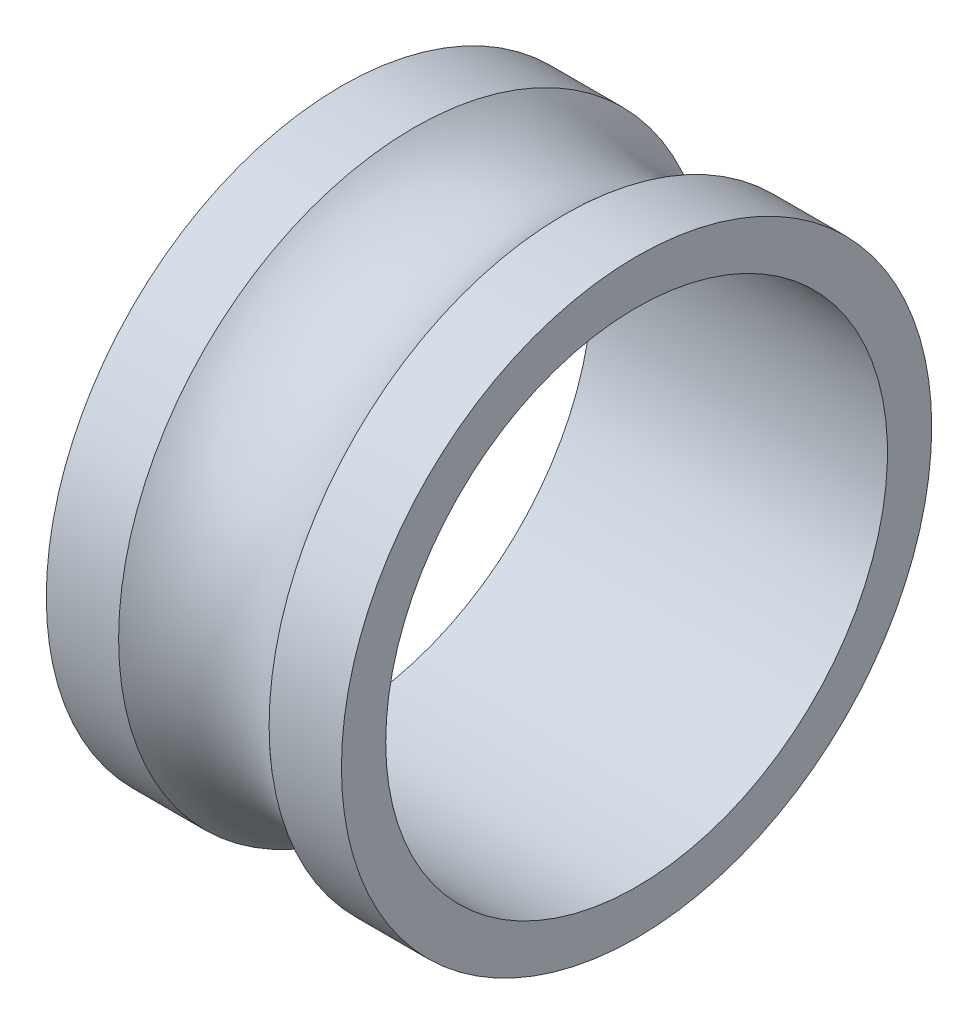
ISO-10303-21;
HEADER;
FILE_DESCRIPTION(('STEP AP214'),'2;1');
FILE_NAME('part.step','',(''),(''),'','','');
FILE_SCHEMA(('AUTOMOTIVE_DESIGN { 1 0 10303 214 1 1 1 1 }'));
ENDSEC;
DATA;
#1=APPLICATION_CONTEXT('core data for automotive mechanical design processes');
#2=APPLICATION_PROTOCOL_DEFINITION('international standard','automotive_design',2000,#1);
#3=PRODUCT_CONTEXT('',#1,'mechanical');
#4=PRODUCT('Part','Part','',(#3));
#5=PRODUCT_RELATED_PRODUCT_CATEGORY('part','',(#4));
#6=PRODUCT_DEFINITION_FORMATION('','',#4);
#7=PRODUCT_DEFINITION_CONTEXT('part definition',#1,'design');
#8=PRODUCT_DEFINITION('design','',#6,#7);
#9=PRODUCT_DEFINITION_SHAPE('','',#8);
#10=(LENGTH_UNIT() NAMED_UNIT(*) SI_UNIT(.MILLI.,.METRE.));
#11=(NAMED_UNIT(*) PLANE_ANGLE_UNIT() SI_UNIT($,.RADIAN.));
#12=(NAMED_UNIT(*) SI_UNIT($,.STERADIAN.) SOLID_ANGLE_UNIT());
#13=UNCERTAINTY_MEASURE_WITH_UNIT(LENGTH_MEASURE(1.E-05),#10,'distance_accuracy_value','');
#14=(GEOMETRIC_REPRESENTATION_CONTEXT(3) GLOBAL_UNCERTAINTY_ASSIGNED_CONTEXT((#13)) GLOBAL_UNIT_ASSIGNED_CONTEXT((#10,
#11,#12)) REPRESENTATION_CONTEXT('',''));
#15=CARTESIAN_POINT('',(0.,0.,0.));
#16=DIRECTION('',(0.,0.,1.));
#17=DIRECTION('',(1.,0.,0.));
#18=AXIS2_PLACEMENT_3D('',#15,#16,#17);
#19=CARTESIAN_POINT('',(10.,0.,-20.));
#20=DIRECTION('',(-1.,0.,0.));
#21=DIRECTION('',(0.,0.,1.));
#22=AXIS2_PLACEMENT_3D('',#19,#20,#21);
#23=PLANE('',#22);
#24=CARTESIAN_POINT('',(10.,0.,0.));
#25=DIRECTION('',(-1.,0.,0.));
#26=DIRECTION('',(0.,0.,1.));
#27=AXIS2_PLACEMENT_3D('',#24,#25,#26);
#28=CIRCLE('',#27,20.);
#29=CARTESIAN_POINT('',(10.,0.,20.));
#30=VERTEX_POINT('',#29);
#31=EDGE_CURVE('E10',#30,#30,#28,.T.);
#32=ORIENTED_EDGE('',*,*,#31,.F.);
#33=EDGE_LOOP('',(#32));
#34=FACE_BOUND('',#33,.T.);
#35=CARTESIAN_POINT('',(10.,0.,0.));
#36=DIRECTION('',(-1.,0.,0.));
#37=DIRECTION('',(0.,0.,1.));
#38=AXIS2_PLACEMENT_3D('',#35,#36,#37);
#39=CIRCLE('',#38,17.);
#40=CARTESIAN_POINT('',(10.,0.,17.));
#41=VERTEX_POINT('',#40);
#42=EDGE_CURVE('E36',#41,#41,#39,.T.);
#43=ORIENTED_EDGE('',*,*,#42,.T.);
#44=EDGE_LOOP('',(#43));
#45=FACE_BOUND('',#44,.T.);
#46=ADVANCED_FACE('F14',(#34,#45),#23,.F.);
#47=CARTESIAN_POINT('',(0.,0.,0.));
#48=DIRECTION('',(-1.,0.,0.));
#49=DIRECTION('',(0.,0.,1.));
#50=AXIS2_PLACEMENT_3D('',#47,#48,#49);
#51=CYLINDRICAL_SURFACE('',#50,20.);
#52=CARTESIAN_POINT('',(5.09901951359279,0.,0.));
#53=DIRECTION('',(-1.,0.,0.));
#54=DIRECTION('',(0.,0.,1.));
#55=AXIS2_PLACEMENT_3D('',#52,#53,#54);
#56=CIRCLE('',#55,20.);
#57=CARTESIAN_POINT('',(5.09901951359279,0.,20.));
#58=VERTEX_POINT('',#57);
#59=EDGE_CURVE('E20',#58,#58,#56,.T.);
#60=ORIENTED_EDGE('',*,*,#59,.F.);
#61=EDGE_LOOP('',(#60));
#62=FACE_BOUND('',#61,.T.);
#63=ORIENTED_EDGE('',*,*,#31,.T.);
#64=EDGE_LOOP('',(#63));
#65=FACE_BOUND('',#64,.T.);
#66=ADVANCED_FACE('F61',(#62,#65),#51,.T.);
#67=CARTESIAN_POINT('',(0.,0.,0.));
#68=DIRECTION('',(-1.,0.,0.));
#69=DIRECTION('',(0.,0.,1.));
#70=AXIS2_PLACEMENT_3D('',#67,#68,#69);
#71=TOROIDAL_SURFACE('',#70,25.5,7.5);
#72=CARTESIAN_POINT('',(-5.09901951359279,0.,0.));
#73=DIRECTION('',(-1.,0.,0.));
#74=DIRECTION('',(0.,0.,1.));
#75=AXIS2_PLACEMENT_3D('',#72,#73,#74);
#76=CIRCLE('',#75,20.);
#77=CARTESIAN_POINT('',(-5.09901951359279,0.,20.));
#78=VERTEX_POINT('',#77);
#79=EDGE_CURVE('E24',#78,#78,#76,.T.);
#80=ORIENTED_EDGE('',*,*,#79,.F.);
#81=EDGE_LOOP('',(#80));
#82=FACE_BOUND('',#81,.T.);
#83=ORIENTED_EDGE('',*,*,#59,.T.);
#84=EDGE_LOOP('',(#83));
#85=FACE_BOUND('',#84,.T.);
#86=ADVANCED_FACE('F56',(#82,#85),#71,.F.);
#87=CARTESIAN_POINT('',(0.,0.,0.));
#88=DIRECTION('',(-1.,0.,0.));
#89=DIRECTION('',(0.,0.,1.));
#90=AXIS2_PLACEMENT_3D('',#87,#88,#89);
#91=CYLINDRICAL_SURFACE('',#90,20.);
#92=CARTESIAN_POINT('',(-10.,0.,0.));
#93=DIRECTION('',(-1.,0.,0.));
#94=DIRECTION('',(0.,0.,1.));
#95=AXIS2_PLACEMENT_3D('',#92,#93,#94);
#96=CIRCLE('',#95,20.);
#97=CARTESIAN_POINT('',(-10.,0.,20.));
#98=VERTEX_POINT('',#97);
#99=EDGE_CURVE('E28',#98,#98,#96,.T.);
#100=ORIENTED_EDGE('',*,*,#99,.F.);
#101=EDGE_LOOP('',(#100));
#102=FACE_BOUND('',#101,.T.);
#103=ORIENTED_EDGE('',*,*,#79,.T.);
#104=EDGE_LOOP('',(#103));
#105=FACE_BOUND('',#104,.T.);
#106=ADVANCED_FACE('F50',(#102,#105),#91,.T.);
#107=CARTESIAN_POINT('',(-10.,0.,-20.));
#108=DIRECTION('',(1.,0.,0.));
#109=DIRECTION('',(0.,0.,-1.));
#110=AXIS2_PLACEMENT_3D('',#107,#108,#109);
#111=PLANE('',#110);
#112=CARTESIAN_POINT('',(-10.,0.,0.));
#113=DIRECTION('',(-1.,0.,0.));
#114=DIRECTION('',(0.,0.,1.));
#115=AXIS2_PLACEMENT_3D('',#112,#113,#114);
#116=CIRCLE('',#115,17.);
#117=CARTESIAN_POINT('',(-10.,0.,17.));
#118=VERTEX_POINT('',#117);
#119=EDGE_CURVE('E33',#118,#118,#116,.T.);
#120=ORIENTED_EDGE('',*,*,#119,.F.);
#121=EDGE_LOOP('',(#120));
#122=FACE_BOUND('',#121,.T.);
#123=ORIENTED_EDGE('',*,*,#99,.T.);
#124=EDGE_LOOP('',(#123));
#125=FACE_BOUND('',#124,.T.);
#126=ADVANCED_FACE('F44',(#122,#125),#111,.F.);
#127=CARTESIAN_POINT('',(0.,0.,0.));
#128=DIRECTION('',(-1.,0.,0.));
#129=DIRECTION('',(0.,0.,1.));
#130=AXIS2_PLACEMENT_3D('',#127,#128,#129);
#131=CYLINDRICAL_SURFACE('',#130,17.);
#132=ORIENTED_EDGE('',*,*,#42,.F.);
#133=EDGE_LOOP('',(#132));
#134=FACE_BOUND('',#133,.T.);
#135=ORIENTED_EDGE('',*,*,#119,.T.);
#136=EDGE_LOOP('',(#135));
#137=FACE_BOUND('',#136,.T.);
#138=ADVANCED_FACE('F41',(#134,#137),#131,.F.);
#139=CLOSED_SHELL('',(#46,#66,#86,#106,#126,#138));
#140=MANIFOLD_SOLID_BREP('B1',#139);
#141=ADVANCED_BREP_SHAPE_REPRESENTATION('',(#18,#140),#14);
#142=SHAPE_DEFINITION_REPRESENTATION(#9,#141);
ENDSEC;
END-ISO-10303-21;
